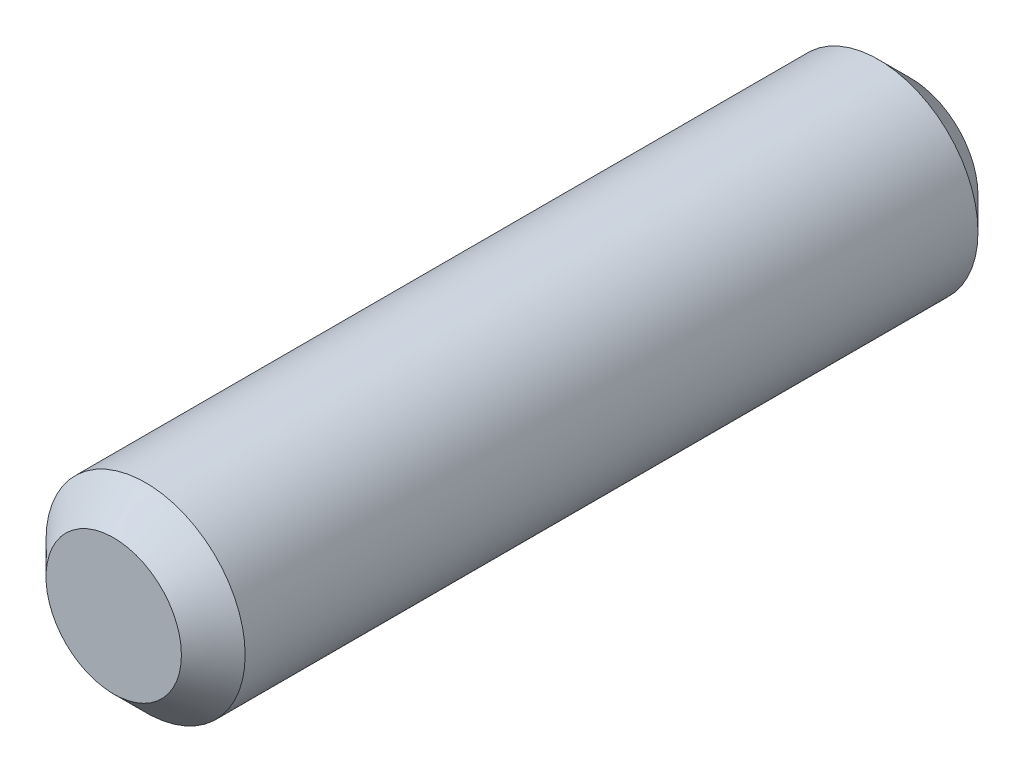
ISO-10303-21;
HEADER;
FILE_DESCRIPTION(('STEP AP214'),'2;1');
FILE_NAME('part.step','',(''),(''),'','','');
FILE_SCHEMA(('AUTOMOTIVE_DESIGN { 1 0 10303 214 1 1 1 1 }'));
ENDSEC;
DATA;
#1=APPLICATION_CONTEXT('core data for automotive mechanical design processes');
#2=APPLICATION_PROTOCOL_DEFINITION('international standard','automotive_design',2000,#1);
#3=PRODUCT_CONTEXT('',#1,'mechanical');
#4=PRODUCT('Part','Part','',(#3));
#5=PRODUCT_RELATED_PRODUCT_CATEGORY('part','',(#4));
#6=PRODUCT_DEFINITION_FORMATION('','',#4);
#7=PRODUCT_DEFINITION_CONTEXT('part definition',#1,'design');
#8=PRODUCT_DEFINITION('design','',#6,#7);
#9=PRODUCT_DEFINITION_SHAPE('','',#8);
#10=(LENGTH_UNIT() NAMED_UNIT(*) SI_UNIT(.MILLI.,.METRE.));
#11=(NAMED_UNIT(*) PLANE_ANGLE_UNIT() SI_UNIT($,.RADIAN.));
#12=(NAMED_UNIT(*) SI_UNIT($,.STERADIAN.) SOLID_ANGLE_UNIT());
#13=UNCERTAINTY_MEASURE_WITH_UNIT(LENGTH_MEASURE(1.E-05),#10,'distance_accuracy_value','');
#14=(GEOMETRIC_REPRESENTATION_CONTEXT(3) GLOBAL_UNCERTAINTY_ASSIGNED_CONTEXT((#13)) GLOBAL_UNIT_ASSIGNED_CONTEXT((#10,
#11,#12)) REPRESENTATION_CONTEXT('',''));
#15=CARTESIAN_POINT('',(0.,0.,0.));
#16=DIRECTION('',(0.,0.,1.));
#17=DIRECTION('',(1.,0.,0.));
#18=AXIS2_PLACEMENT_3D('',#15,#16,#17);
#19=CARTESIAN_POINT('',(0.,0.,12.7));
#20=DIRECTION('',(0.,0.,-1.));
#21=DIRECTION('',(-1.,0.,0.));
#22=AXIS2_PLACEMENT_3D('',#19,#20,#21);
#23=CYLINDRICAL_SURFACE('',#22,1.5875);
#24=CARTESIAN_POINT('',(0.,0.,0.508000000000002));
#25=DIRECTION('',(0.,0.,1.));
#26=DIRECTION('',(1.,0.,0.));
#27=AXIS2_PLACEMENT_3D('',#24,#25,#26);
#28=CIRCLE('',#27,1.5875);
#29=CARTESIAN_POINT('',(1.5875,0.,0.508000000000002));
#30=VERTEX_POINT('',#29);
#31=EDGE_CURVE('E51',#30,#30,#28,.T.);
#32=ORIENTED_EDGE('',*,*,#31,.T.);
#33=EDGE_LOOP('',(#32));
#34=FACE_BOUND('',#33,.T.);
#35=CARTESIAN_POINT('',(0.,0.,12.192));
#36=DIRECTION('',(0.,0.,1.));
#37=DIRECTION('',(1.,0.,0.));
#38=AXIS2_PLACEMENT_3D('',#35,#36,#37);
#39=CIRCLE('',#38,1.5875);
#40=CARTESIAN_POINT('',(1.5875,0.,12.192));
#41=VERTEX_POINT('',#40);
#42=EDGE_CURVE('E56',#41,#41,#39,.F.);
#43=ORIENTED_EDGE('',*,*,#42,.T.);
#44=EDGE_LOOP('',(#43));
#45=FACE_BOUND('',#44,.T.);
#46=ADVANCED_FACE('F37',(#34,#45),#23,.T.);
#47=CARTESIAN_POINT('',(0.,0.,12.7));
#48=DIRECTION('',(0.,0.,1.));
#49=DIRECTION('',(1.,0.,0.));
#50=AXIS2_PLACEMENT_3D('',#47,#48,#49);
#51=PLANE('',#50);
#52=CARTESIAN_POINT('',(0.,0.,12.7));
#53=DIRECTION('',(0.,0.,1.));
#54=DIRECTION('',(1.,0.,0.));
#55=AXIS2_PLACEMENT_3D('',#52,#53,#54);
#56=CIRCLE('',#55,1.0795);
#57=CARTESIAN_POINT('',(1.0795,0.,12.7));
#58=VERTEX_POINT('',#57);
#59=EDGE_CURVE('E10',#58,#58,#56,.T.);
#60=ORIENTED_EDGE('',*,*,#59,.T.);
#61=EDGE_LOOP('',(#60));
#62=FACE_BOUND('',#61,.T.);
#63=ADVANCED_FACE('F73',(#62),#51,.T.);
#64=CARTESIAN_POINT('',(0.,0.,0.));
#65=DIRECTION('',(0.,0.,1.));
#66=DIRECTION('',(1.,0.,0.));
#67=AXIS2_PLACEMENT_3D('',#64,#65,#66);
#68=PLANE('',#67);
#69=CARTESIAN_POINT('',(0.,0.,0.));
#70=DIRECTION('',(0.,0.,1.));
#71=DIRECTION('',(1.,0.,0.));
#72=AXIS2_PLACEMENT_3D('',#69,#70,#71);
#73=CIRCLE('',#72,1.0795);
#74=CARTESIAN_POINT('',(1.0795,0.,0.));
#75=VERTEX_POINT('',#74);
#76=EDGE_CURVE('E46',#75,#75,#73,.F.);
#77=ORIENTED_EDGE('',*,*,#76,.T.);
#78=EDGE_LOOP('',(#77));
#79=FACE_BOUND('',#78,.T.);
#80=ADVANCED_FACE('F70',(#79),#68,.F.);
#81=CARTESIAN_POINT('',(0.,0.,0.508000000000002));
#82=DIRECTION('',(0.,0.,1.));
#83=DIRECTION('',(1.,0.,0.));
#84=AXIS2_PLACEMENT_3D('',#81,#82,#83);
#85=CONICAL_SURFACE('',#84,1.5875,0.785398163397449);
#86=ORIENTED_EDGE('',*,*,#76,.F.);
#87=EDGE_LOOP('',(#86));
#88=FACE_BOUND('',#87,.T.);
#89=ORIENTED_EDGE('',*,*,#31,.F.);
#90=EDGE_LOOP('',(#89));
#91=FACE_BOUND('',#90,.T.);
#92=ADVANCED_FACE('F66',(#88,#91),#85,.T.);
#93=CARTESIAN_POINT('',(0.,0.,12.7));
#94=DIRECTION('',(0.,0.,-1.));
#95=DIRECTION('',(-1.,0.,0.));
#96=AXIS2_PLACEMENT_3D('',#93,#94,#95);
#97=CONICAL_SURFACE('',#96,1.0795,0.785398163397446);
#98=ORIENTED_EDGE('',*,*,#42,.F.);
#99=EDGE_LOOP('',(#98));
#100=FACE_BOUND('',#99,.T.);
#101=ORIENTED_EDGE('',*,*,#59,.F.);
#102=EDGE_LOOP('',(#101));
#103=FACE_BOUND('',#102,.T.);
#104=ADVANCED_FACE('F40',(#100,#103),#97,.T.);
#105=CLOSED_SHELL('',(#46,#63,#80,#92,#104));
#106=MANIFOLD_SOLID_BREP('B2',#105);
#107=ADVANCED_BREP_SHAPE_REPRESENTATION('',(#18,#106),#14);
#108=SHAPE_DEFINITION_REPRESENTATION(#9,#107);
ENDSEC;
END-ISO-10303-21;
